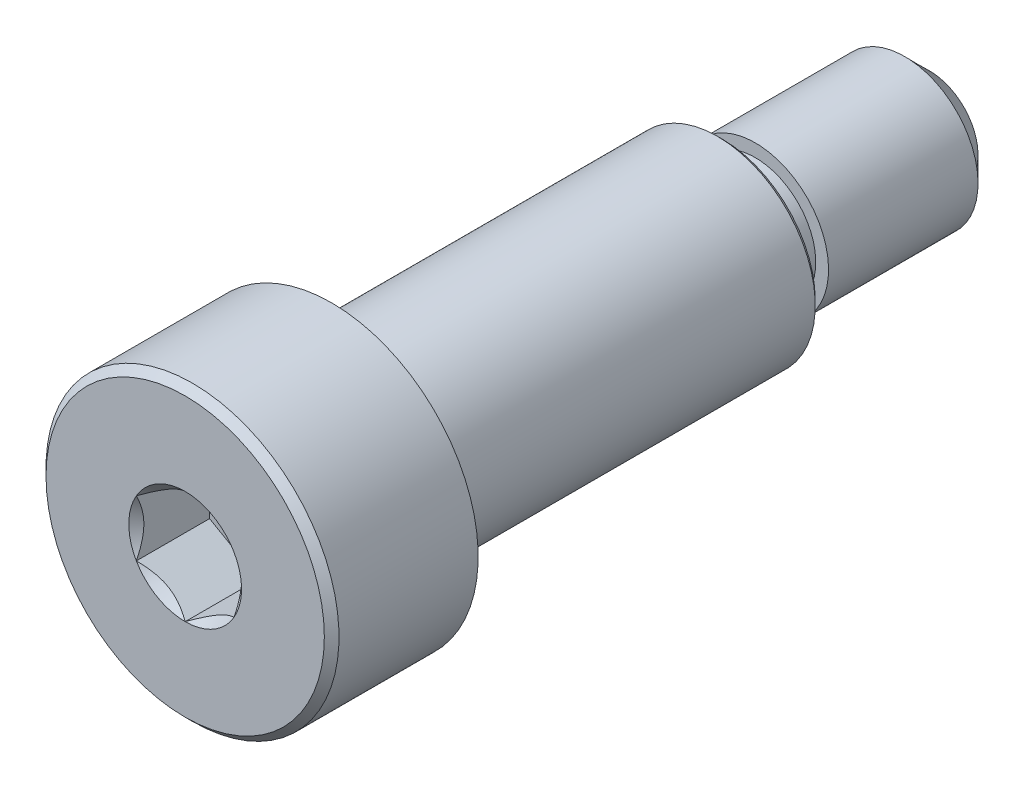
ISO-10303-21;
HEADER;
FILE_DESCRIPTION(('STEP AP214'),'2;1');
FILE_NAME('part.step','',(''),(''),'','','');
FILE_SCHEMA(('AUTOMOTIVE_DESIGN { 1 0 10303 214 1 1 1 1 }'));
ENDSEC;
DATA;
#1=APPLICATION_CONTEXT('core data for automotive mechanical design processes');
#2=APPLICATION_PROTOCOL_DEFINITION('international standard','automotive_design',2000,#1);
#3=PRODUCT_CONTEXT('',#1,'mechanical');
#4=PRODUCT('Part','Part','',(#3));
#5=PRODUCT_RELATED_PRODUCT_CATEGORY('part','',(#4));
#6=PRODUCT_DEFINITION_FORMATION('','',#4);
#7=PRODUCT_DEFINITION_CONTEXT('part definition',#1,'design');
#8=PRODUCT_DEFINITION('design','',#6,#7);
#9=PRODUCT_DEFINITION_SHAPE('','',#8);
#10=(LENGTH_UNIT() NAMED_UNIT(*) SI_UNIT(.MILLI.,.METRE.));
#11=(NAMED_UNIT(*) PLANE_ANGLE_UNIT() SI_UNIT($,.RADIAN.));
#12=(NAMED_UNIT(*) SI_UNIT($,.STERADIAN.) SOLID_ANGLE_UNIT());
#13=UNCERTAINTY_MEASURE_WITH_UNIT(LENGTH_MEASURE(1.E-05),#10,'distance_accuracy_value','');
#14=(GEOMETRIC_REPRESENTATION_CONTEXT(3) GLOBAL_UNCERTAINTY_ASSIGNED_CONTEXT((#13)) GLOBAL_UNIT_ASSIGNED_CONTEXT((#10,
#11,#12)) REPRESENTATION_CONTEXT('',''));
#15=CARTESIAN_POINT('',(0.,0.,0.));
#16=DIRECTION('',(0.,0.,1.));
#17=DIRECTION('',(1.,0.,0.));
#18=AXIS2_PLACEMENT_3D('',#15,#16,#17);
#19=CARTESIAN_POINT('',(0.,0.,7.621));
#20=DIRECTION('',(0.,0.,1.));
#21=DIRECTION('',(0.,-1.,0.));
#22=AXIS2_PLACEMENT_3D('',#19,#20,#21);
#23=CYLINDRICAL_SURFACE('',#22,3.);
#24=CARTESIAN_POINT('',(0.,0.,4.621));
#25=DIRECTION('',(0.,0.,1.));
#26=DIRECTION('',(0.,-1.,0.));
#27=AXIS2_PLACEMENT_3D('',#24,#25,#26);
#28=CIRCLE('',#27,3.);
#29=CARTESIAN_POINT('',(0.,-3.,4.621));
#30=VERTEX_POINT('',#29);
#31=EDGE_CURVE('E195',#30,#30,#28,.T.);
#32=ORIENTED_EDGE('',*,*,#31,.T.);
#33=EDGE_LOOP('',(#32));
#34=FACE_BOUND('',#33,.T.);
#35=CARTESIAN_POINT('',(0.,0.,7.471));
#36=DIRECTION('',(0.,0.,1.));
#37=DIRECTION('',(0.,-1.,0.));
#38=AXIS2_PLACEMENT_3D('',#35,#36,#37);
#39=CIRCLE('',#38,3.);
#40=CARTESIAN_POINT('',(0.,-3.,7.471));
#41=VERTEX_POINT('',#40);
#42=EDGE_CURVE('E455',#41,#41,#39,.T.);
#43=ORIENTED_EDGE('',*,*,#42,.F.);
#44=EDGE_LOOP('',(#43));
#45=FACE_BOUND('',#44,.T.);
#46=ADVANCED_FACE('F49',(#34,#45),#23,.T.);
#47=CARTESIAN_POINT('',(0.,2.,-3.379));
#48=DIRECTION('',(0.,0.,1.));
#49=DIRECTION('',(0.,-1.,0.));
#50=AXIS2_PLACEMENT_3D('',#47,#48,#49);
#51=PLANE('',#50);
#52=CARTESIAN_POINT('',(0.,0.,-3.379));
#53=DIRECTION('',(0.,0.,1.));
#54=DIRECTION('',(0.,-1.,0.));
#55=AXIS2_PLACEMENT_3D('',#52,#53,#54);
#56=CIRCLE('',#55,1.36904775);
#57=CARTESIAN_POINT('',(0.,-1.36904775,-3.379));
#58=VERTEX_POINT('',#57);
#59=EDGE_CURVE('E159',#58,#58,#56,.T.);
#60=ORIENTED_EDGE('',*,*,#59,.T.);
#61=EDGE_LOOP('',(#60));
#62=FACE_BOUND('',#61,.T.);
#63=CARTESIAN_POINT('',(0.,0.,-3.379));
#64=DIRECTION('',(0.,0.,1.));
#65=DIRECTION('',(0.,-1.,0.));
#66=AXIS2_PLACEMENT_3D('',#63,#64,#65);
#67=CIRCLE('',#66,1.5);
#68=CARTESIAN_POINT('',(0.,-1.5,-3.379));
#69=VERTEX_POINT('',#68);
#70=EDGE_CURVE('E186',#69,#69,#67,.T.);
#71=ORIENTED_EDGE('',*,*,#70,.F.);
#72=EDGE_LOOP('',(#71));
#73=FACE_BOUND('',#72,.T.);
#74=ADVANCED_FACE('F285',(#62,#73),#51,.F.);
#75=CARTESIAN_POINT('',(0.,1.5,-7.621));
#76=DIRECTION('',(0.,0.,1.));
#77=DIRECTION('',(0.,-1.,0.));
#78=AXIS2_PLACEMENT_3D('',#75,#76,#77);
#79=PLANE('',#78);
#80=CARTESIAN_POINT('',(0.,0.,-7.621));
#81=DIRECTION('',(0.,0.,1.));
#82=DIRECTION('',(0.,-1.,0.));
#83=AXIS2_PLACEMENT_3D('',#80,#81,#82);
#84=CIRCLE('',#83,0.993851983500002);
#85=CARTESIAN_POINT('',(0.,-0.993851983500002,-7.621));
#86=VERTEX_POINT('',#85);
#87=EDGE_CURVE('E12',#86,#86,#84,.F.);
#88=ORIENTED_EDGE('',*,*,#87,.T.);
#89=EDGE_LOOP('',(#88));
#90=FACE_BOUND('',#89,.T.);
#91=ADVANCED_FACE('F293',(#90),#79,.F.);
#92=CARTESIAN_POINT('',(0.,0.,7.621));
#93=DIRECTION('',(0.,0.,1.));
#94=DIRECTION('',(0.,-1.,0.));
#95=AXIS2_PLACEMENT_3D('',#92,#93,#94);
#96=CYLINDRICAL_SURFACE('',#95,1.5);
#97=CARTESIAN_POINT('',(0.,0.,-7.1148519835));
#98=DIRECTION('',(0.,0.,1.));
#99=DIRECTION('',(0.,-1.,0.));
#100=AXIS2_PLACEMENT_3D('',#97,#98,#99);
#101=CIRCLE('',#100,1.5);
#102=CARTESIAN_POINT('',(0.,-1.5,-7.1148519835));
#103=VERTEX_POINT('',#102);
#104=EDGE_CURVE('E58',#103,#103,#101,.T.);
#105=ORIENTED_EDGE('',*,*,#104,.T.);
#106=EDGE_LOOP('',(#105));
#107=FACE_BOUND('',#106,.T.);
#108=CARTESIAN_POINT('',(0.,0.,-4.053864022));
#109=DIRECTION('',(0.,0.,1.));
#110=DIRECTION('',(0.,-1.,0.));
#111=AXIS2_PLACEMENT_3D('',#108,#109,#110);
#112=CIRCLE('',#111,1.5);
#113=CARTESIAN_POINT('',(0.,-1.5,-4.053864022));
#114=VERTEX_POINT('',#113);
#115=EDGE_CURVE('E174',#114,#114,#112,.T.);
#116=ORIENTED_EDGE('',*,*,#115,.F.);
#117=EDGE_LOOP('',(#116));
#118=FACE_BOUND('',#117,.T.);
#119=ADVANCED_FACE('F489',(#107,#118),#96,.T.);
#120=CARTESIAN_POINT('',(0.,1.2380955,-4.053864022));
#121=DIRECTION('',(0.,0.,-1.));
#122=DIRECTION('',(0.,1.,0.));
#123=AXIS2_PLACEMENT_3D('',#120,#121,#122);
#124=PLANE('',#123);
#125=CARTESIAN_POINT('',(0.,0.,-4.053864022));
#126=DIRECTION('',(0.,0.,1.));
#127=DIRECTION('',(0.,-1.,0.));
#128=AXIS2_PLACEMENT_3D('',#125,#126,#127);
#129=CIRCLE('',#128,1.2380955);
#130=CARTESIAN_POINT('',(0.,-1.2380955,-4.053864022));
#131=VERTEX_POINT('',#130);
#132=EDGE_CURVE('E178',#131,#131,#129,.T.);
#133=ORIENTED_EDGE('',*,*,#132,.F.);
#134=EDGE_LOOP('',(#133));
#135=FACE_BOUND('',#134,.T.);
#136=ORIENTED_EDGE('',*,*,#115,.T.);
#137=EDGE_LOOP('',(#136));
#138=FACE_BOUND('',#137,.T.);
#139=ADVANCED_FACE('F332',(#135,#138),#124,.F.);
#140=CARTESIAN_POINT('',(0.,0.,7.621));
#141=DIRECTION('',(0.,0.,1.));
#142=DIRECTION('',(0.,-1.,0.));
#143=AXIS2_PLACEMENT_3D('',#140,#141,#142);
#144=CYLINDRICAL_SURFACE('',#143,1.2380955);
#145=CARTESIAN_POINT('',(0.,0.,-3.50995225));
#146=DIRECTION('',(0.,0.,1.));
#147=DIRECTION('',(0.,-1.,0.));
#148=AXIS2_PLACEMENT_3D('',#145,#146,#147);
#149=CIRCLE('',#148,1.2380955);
#150=CARTESIAN_POINT('',(0.,-1.2380955,-3.50995225));
#151=VERTEX_POINT('',#150);
#152=EDGE_CURVE('E182',#151,#151,#149,.T.);
#153=ORIENTED_EDGE('',*,*,#152,.F.);
#154=EDGE_LOOP('',(#153));
#155=FACE_BOUND('',#154,.T.);
#156=ORIENTED_EDGE('',*,*,#132,.T.);
#157=EDGE_LOOP('',(#156));
#158=FACE_BOUND('',#157,.T.);
#159=ADVANCED_FACE('F319',(#155,#158),#144,.T.);
#160=CARTESIAN_POINT('',(0.,0.,-3.50995225));
#161=DIRECTION('',(0.,0.,1.));
#162=DIRECTION('',(0.,-1.,0.));
#163=AXIS2_PLACEMENT_3D('',#160,#161,#162);
#164=TOROIDAL_SURFACE('',#163,1.36904775,0.13095225);
#165=ORIENTED_EDGE('',*,*,#59,.F.);
#166=EDGE_LOOP('',(#165));
#167=FACE_BOUND('',#166,.T.);
#168=ORIENTED_EDGE('',*,*,#152,.T.);
#169=EDGE_LOOP('',(#168));
#170=FACE_BOUND('',#169,.T.);
#171=ADVANCED_FACE('F314',(#167,#170),#164,.F.);
#172=CARTESIAN_POINT('',(0.,0.,-3.379));
#173=DIRECTION('',(0.,0.,-1.));
#174=DIRECTION('',(0.,1.,0.));
#175=AXIS2_PLACEMENT_3D('',#172,#173,#174);
#176=CONICAL_SURFACE('',#175,1.5,1.53309033997236);
#177=CARTESIAN_POINT('',(0.,0.,-3.3775637422897));
#178=DIRECTION('',(0.,0.,1.));
#179=DIRECTION('',(0.,-1.,0.));
#180=AXIS2_PLACEMENT_3D('',#177,#178,#179);
#181=CIRCLE('',#180,1.46192708096574);
#182=CARTESIAN_POINT('',(0.,-1.46192708096574,-3.3775637422897));
#183=VERTEX_POINT('',#182);
#184=EDGE_CURVE('E199',#183,#183,#181,.T.);
#185=ORIENTED_EDGE('',*,*,#184,.F.);
#186=EDGE_LOOP('',(#185));
#187=FACE_BOUND('',#186,.T.);
#188=ORIENTED_EDGE('',*,*,#70,.T.);
#189=EDGE_LOOP('',(#188));
#190=FACE_BOUND('',#189,.T.);
#191=ADVANCED_FACE('F311',(#187,#190),#176,.T.);
#192=CARTESIAN_POINT('',(0.,0.,4.4954362577103));
#193=DIRECTION('',(0.,0.,-1.));
#194=DIRECTION('',(0.,1.,0.));
#195=AXIS2_PLACEMENT_3D('',#192,#193,#194);
#196=CONICAL_SURFACE('',#195,1.75892708096574,1.53309033997227);
#197=CARTESIAN_POINT('',(0.,0.,4.494));
#198=DIRECTION('',(0.,0.,1.));
#199=DIRECTION('',(0.,-1.,0.));
#200=AXIS2_PLACEMENT_3D('',#197,#198,#199);
#201=CIRCLE('',#200,1.797);
#202=CARTESIAN_POINT('',(0.,-1.797,4.494));
#203=VERTEX_POINT('',#202);
#204=EDGE_CURVE('E194',#203,#203,#201,.T.);
#205=ORIENTED_EDGE('',*,*,#204,.F.);
#206=EDGE_LOOP('',(#205));
#207=FACE_BOUND('',#206,.T.);
#208=CARTESIAN_POINT('',(0.,0.,4.4954362577103));
#209=DIRECTION('',(0.,0.,1.));
#210=DIRECTION('',(0.,-1.,0.));
#211=AXIS2_PLACEMENT_3D('',#208,#209,#210);
#212=CIRCLE('',#211,1.75892708096574);
#213=CARTESIAN_POINT('',(0.,-1.75892708096574,4.4954362577103));
#214=VERTEX_POINT('',#213);
#215=EDGE_CURVE('E200',#214,#214,#212,.T.);
#216=ORIENTED_EDGE('',*,*,#215,.T.);
#217=EDGE_LOOP('',(#216));
#218=FACE_BOUND('',#217,.T.);
#219=ADVANCED_FACE('F307',(#207,#218),#196,.F.);
#220=CARTESIAN_POINT('',(0.,0.,4.4954362577103));
#221=DIRECTION('',(0.,0.,1.));
#222=DIRECTION('',(0.,-1.,0.));
#223=AXIS2_PLACEMENT_3D('',#220,#221,#222);
#224=CONICAL_SURFACE('',#223,1.75892708096574,0.0377059868226227);
#225=ORIENTED_EDGE('',*,*,#184,.T.);
#226=EDGE_LOOP('',(#225));
#227=FACE_BOUND('',#226,.T.);
#228=ORIENTED_EDGE('',*,*,#215,.F.);
#229=EDGE_LOOP('',(#228));
#230=FACE_BOUND('',#229,.T.);
#231=ADVANCED_FACE('F304',(#227,#230),#224,.T.);
#232=CARTESIAN_POINT('',(0.,3.,4.621));
#233=DIRECTION('',(0.,0.,1.));
#234=DIRECTION('',(0.,-1.,0.));
#235=AXIS2_PLACEMENT_3D('',#232,#233,#234);
#236=PLANE('',#235);
#237=ORIENTED_EDGE('',*,*,#31,.F.);
#238=EDGE_LOOP('',(#237));
#239=FACE_BOUND('',#238,.T.);
#240=CARTESIAN_POINT('',(0.,0.,4.621));
#241=DIRECTION('',(0.,0.,1.));
#242=DIRECTION('',(0.,-1.,0.));
#243=AXIS2_PLACEMENT_3D('',#240,#241,#242);
#244=CIRCLE('',#243,1.797);
#245=CARTESIAN_POINT('',(0.,-1.797,4.621));
#246=VERTEX_POINT('',#245);
#247=EDGE_CURVE('E190',#246,#246,#244,.T.);
#248=ORIENTED_EDGE('',*,*,#247,.T.);
#249=EDGE_LOOP('',(#248));
#250=FACE_BOUND('',#249,.T.);
#251=ADVANCED_FACE('F298',(#239,#250),#236,.F.);
#252=CARTESIAN_POINT('',(0.,0.,7.621));
#253=DIRECTION('',(0.,0.,1.));
#254=DIRECTION('',(0.,-1.,0.));
#255=AXIS2_PLACEMENT_3D('',#252,#253,#254);
#256=CYLINDRICAL_SURFACE('',#255,1.797);
#257=ORIENTED_EDGE('',*,*,#247,.F.);
#258=EDGE_LOOP('',(#257));
#259=FACE_BOUND('',#258,.T.);
#260=ORIENTED_EDGE('',*,*,#204,.T.);
#261=EDGE_LOOP('',(#260));
#262=FACE_BOUND('',#261,.T.);
#263=ADVANCED_FACE('F338',(#259,#262),#256,.T.);
#264=CARTESIAN_POINT('',(0.,0.,-7.1148519835));
#265=DIRECTION('',(0.,0.,1.));
#266=DIRECTION('',(0.,-1.,0.));
#267=AXIS2_PLACEMENT_3D('',#264,#265,#266);
#268=CONICAL_SURFACE('',#267,1.5,0.785398163397447);
#269=ORIENTED_EDGE('',*,*,#87,.F.);
#270=EDGE_LOOP('',(#269));
#271=FACE_BOUND('',#270,.T.);
#272=ORIENTED_EDGE('',*,*,#104,.F.);
#273=EDGE_LOOP('',(#272));
#274=FACE_BOUND('',#273,.T.);
#275=ADVANCED_FACE('F51',(#271,#274),#268,.T.);
#276=CARTESIAN_POINT('',(0.,0.,7.621));
#277=DIRECTION('',(0.,0.,-1.));
#278=DIRECTION('',(0.,1.,0.));
#279=AXIS2_PLACEMENT_3D('',#276,#277,#278);
#280=CONICAL_SURFACE('',#279,2.85,0.785398163397443);
#281=ORIENTED_EDGE('',*,*,#42,.T.);
#282=EDGE_LOOP('',(#281));
#283=FACE_BOUND('',#282,.T.);
#284=CARTESIAN_POINT('',(0.,0.,7.621));
#285=DIRECTION('',(0.,0.,1.));
#286=DIRECTION('',(0.,-1.,0.));
#287=AXIS2_PLACEMENT_3D('',#284,#285,#286);
#288=CIRCLE('',#287,2.85);
#289=CARTESIAN_POINT('',(0.,-2.85,7.621));
#290=VERTEX_POINT('',#289);
#291=EDGE_CURVE('E458',#290,#290,#288,.T.);
#292=ORIENTED_EDGE('',*,*,#291,.F.);
#293=EDGE_LOOP('',(#292));
#294=FACE_BOUND('',#293,.T.);
#295=ADVANCED_FACE('F230',(#283,#294),#280,.T.);
#296=CARTESIAN_POINT('',(0.,0.,6.121));
#297=DIRECTION('',(0.,0.,1.));
#298=DIRECTION('',(1.,0.,0.));
#299=AXIS2_PLACEMENT_3D('',#296,#297,#298);
#300=PLANE('',#299);
#301=DIRECTION('',(-0.866025403784439,0.499999999999999,0.));
#302=VECTOR('',#301,1.);
#303=CARTESIAN_POINT('',(0.999999999999999,0.577350269189627,6.121));
#304=LINE('',#303,#302);
#305=CARTESIAN_POINT('',(0.999999999999999,0.577350269189627,6.121));
#306=VERTEX_POINT('',#305);
#307=CARTESIAN_POINT('',(0.,1.15470053837925,6.121));
#308=VERTEX_POINT('',#307);
#309=EDGE_CURVE('E109',#306,#308,#304,.T.);
#310=ORIENTED_EDGE('',*,*,#309,.T.);
#311=DIRECTION('',(-0.866025403784438,-0.5,0.));
#312=VECTOR('',#311,1.);
#313=CARTESIAN_POINT('',(0.,1.15470053837925,6.121));
#314=LINE('',#313,#312);
#315=CARTESIAN_POINT('',(-1.,0.577350269189626,6.121));
#316=VERTEX_POINT('',#315);
#317=EDGE_CURVE('E120',#308,#316,#314,.T.);
#318=ORIENTED_EDGE('',*,*,#317,.T.);
#319=DIRECTION('',(0.,-1.,0.));
#320=VECTOR('',#319,1.);
#321=CARTESIAN_POINT('',(-1.,0.577350269189626,6.121));
#322=LINE('',#321,#320);
#323=CARTESIAN_POINT('',(-1.,-0.577350269189625,6.121));
#324=VERTEX_POINT('',#323);
#325=EDGE_CURVE('E127',#316,#324,#322,.T.);
#326=ORIENTED_EDGE('',*,*,#325,.T.);
#327=DIRECTION('',(0.866025403784439,-0.499999999999999,0.));
#328=VECTOR('',#327,1.);
#329=CARTESIAN_POINT('',(-1.,-0.577350269189625,6.121));
#330=LINE('',#329,#328);
#331=CARTESIAN_POINT('',(0.,-1.15470053837925,6.121));
#332=VERTEX_POINT('',#331);
#333=EDGE_CURVE('E147',#324,#332,#330,.T.);
#334=ORIENTED_EDGE('',*,*,#333,.T.);
#335=DIRECTION('',(0.866025403784438,0.5,0.));
#336=VECTOR('',#335,1.);
#337=CARTESIAN_POINT('',(0.,-1.15470053837925,6.121));
#338=LINE('',#337,#336);
#339=CARTESIAN_POINT('',(0.999999999999999,-0.577350269189625,6.121));
#340=VERTEX_POINT('',#339);
#341=EDGE_CURVE('E151',#332,#340,#338,.T.);
#342=ORIENTED_EDGE('',*,*,#341,.T.);
#343=DIRECTION('',(0.,1.,0.));
#344=VECTOR('',#343,1.);
#345=CARTESIAN_POINT('',(0.999999999999999,-0.577350269189625,6.121));
#346=LINE('',#345,#344);
#347=EDGE_CURVE('E117',#340,#306,#346,.T.);
#348=ORIENTED_EDGE('',*,*,#347,.T.);
#349=EDGE_LOOP('',(#310,#318,#326,#334,#342,#348));
#350=FACE_BOUND('',#349,.T.);
#351=ADVANCED_FACE('F129',(#350),#300,.T.);
#352=CARTESIAN_POINT('',(-1.,0.577350269189626,6.121));
#353=DIRECTION('',(-1.,0.,0.));
#354=DIRECTION('',(0.,-1.,0.));
#355=AXIS2_PLACEMENT_3D('',#352,#353,#354);
#356=PLANE('',#355);
#357=DIRECTION('',(0.,0.,1.));
#358=VECTOR('',#357,1.);
#359=CARTESIAN_POINT('',(-1.,0.577350269189626,6.121));
#360=LINE('',#359,#358);
#361=CARTESIAN_POINT('',(-0.999999999999999,0.577350269189627,7.621));
#362=VERTEX_POINT('',#361);
#363=EDGE_CURVE('E116',#316,#362,#360,.T.);
#364=ORIENTED_EDGE('',*,*,#363,.T.);
#365=CARTESIAN_POINT('',(-1.,-1.15147208646462,7.99138567751386));
#366=CARTESIAN_POINT('',(-1.,-1.12343447988552,7.97021991987371));
#367=CARTESIAN_POINT('',(-1.,-1.09524064850697,7.94926169217591));
#368=CARTESIAN_POINT('',(-1.,-1.03847715644376,7.90784602223562));
#369=CARTESIAN_POINT('',(-1.,-1.00990740382975,7.88738870612366));
#370=CARTESIAN_POINT('',(-1.,-0.923120894333477,7.82660479495451));
#371=CARTESIAN_POINT('',(-1.,-0.864253173759059,7.7871922289614));
#372=CARTESIAN_POINT('',(-1.,-0.740809858258045,7.7098206642002));
#373=CARTESIAN_POINT('',(-1.,-0.676100255137807,7.67207303911434));
#374=CARTESIAN_POINT('',(-1.,-0.543448939049124,7.60302458755129));
#375=CARTESIAN_POINT('',(-1.,-0.475519112027779,7.57170202784686));
#376=CARTESIAN_POINT('',(-1.,-0.373555850333529,7.53338177888379));
#377=CARTESIAN_POINT('',(-1.,-0.341031989670908,7.52238359164216));
#378=CARTESIAN_POINT('',(-1.,-0.275199079052293,7.50299834214736));
#379=CARTESIAN_POINT('',(-1.,-0.241889975173933,7.4946114597767));
#380=CARTESIAN_POINT('',(-1.,-0.175247517042993,7.48102522071902));
#381=CARTESIAN_POINT('',(-1.,-0.141925568218175,7.47577079076797));
#382=CARTESIAN_POINT('',(-1.,-0.0749144362322795,7.46854868657089));
#383=CARTESIAN_POINT('',(-1.,-0.0412251978501624,7.46658151361051));
#384=CARTESIAN_POINT('',(-1.,0.0249580992634202,7.46608319839316));
#385=CARTESIAN_POINT('',(-1.,0.0574512826460384,7.46743026788863));
#386=CARTESIAN_POINT('',(-1.,0.122148505701866,7.47321648449898));
#387=CARTESIAN_POINT('',(-1.,0.154352610132926,7.47765492066153));
#388=CARTESIAN_POINT('',(-1.,0.218799898867639,7.4894568301452));
#389=CARTESIAN_POINT('',(-1.,0.251033743268953,7.49687054103851));
#390=CARTESIAN_POINT('',(-1.,0.314797132354918,7.51422894249868));
#391=CARTESIAN_POINT('',(-1.,0.346326735731003,7.52417342128883));
#392=CARTESIAN_POINT('',(-1.,0.445594187730203,7.55922348255434));
#393=CARTESIAN_POINT('',(-1.,0.511919139476034,7.58832085835672));
#394=CARTESIAN_POINT('',(-1.,0.64145324465753,7.6530153296865));
#395=CARTESIAN_POINT('',(-1.,0.704650133126342,7.68863577671524));
#396=CARTESIAN_POINT('',(-1.,0.825428490174985,7.76212390134693));
#397=CARTESIAN_POINT('',(-1.,0.883132947867683,7.79979194713546));
#398=CARTESIAN_POINT('',(-1.,0.968148853704564,7.85802285294316));
#399=CARTESIAN_POINT('',(-1.,0.996120570380284,7.87763847576286));
#400=CARTESIAN_POINT('',(-1.,1.05168177729901,7.91738851706127));
#401=CARTESIAN_POINT('',(-1.,1.079271369977,7.93752279219883));
#402=CARTESIAN_POINT('',(-1.,1.10670185346329,7.95787211907297));
#403=B_SPLINE_CURVE_WITH_KNOTS('',3,(#365,#366,#367,#368,#369,#370,#371,#372,#373,#374,#375,
#376,#377,#378,#379,#380,#381,#382,#383,#384,#385,#386,#387,#388,#389,#390,#391,#392,#393,#394,
#395,#396,#397,#398,#399,#400,#401,#402),.UNSPECIFIED.,.F.,.F.,(4,2,2,2,2,2,2,2,2,2,2,2,2,2,2,2,
2,2,4),(0.,0.10538645908329,0.210799187330122,0.423233611565467,0.647793540908502,
0.871580877738608,0.974493074181419,1.07741235827201,1.17846428203204,1.27953161415762,
1.3769408673961,1.47432772585408,1.57343322804293,1.67253043972851,1.88917353996827,
2.10660791038812,2.31323734249843,2.41572589232044,2.51818641476503),.UNSPECIFIED.);
#404=CARTESIAN_POINT('',(-1.,-0.577350269189627,7.621));
#405=VERTEX_POINT('',#404);
#406=EDGE_CURVE('E237',#362,#405,#403,.F.);
#407=ORIENTED_EDGE('',*,*,#406,.T.);
#408=DIRECTION('',(0.,0.,1.));
#409=VECTOR('',#408,1.);
#410=CARTESIAN_POINT('',(-1.,-0.577350269189625,6.121));
#411=LINE('',#410,#409);
#412=EDGE_CURVE('E168',#324,#405,#411,.T.);
#413=ORIENTED_EDGE('',*,*,#412,.F.);
#414=ORIENTED_EDGE('',*,*,#325,.F.);
#415=EDGE_LOOP('',(#364,#407,#413,#414));
#416=FACE_BOUND('',#415,.T.);
#417=ADVANCED_FACE('F275',(#416),#356,.F.);
#418=CARTESIAN_POINT('',(-1.,-0.577350269189625,6.121));
#419=DIRECTION('',(-0.499999999999999,-0.866025403784439,0.));
#420=DIRECTION('',(0.866025403784439,-0.5,0.));
#421=AXIS2_PLACEMENT_3D('',#418,#419,#420);
#422=PLANE('',#421);
#423=ORIENTED_EDGE('',*,*,#412,.T.);
#424=CARTESIAN_POINT('',(-1.0002,-0.577234799135788,7.62111548737261));
#425=CARTESIAN_POINT('',(-0.965817404992819,-0.597085599618621,7.60127793082573));
#426=CARTESIAN_POINT('',(-0.930859881860175,-0.617268335009456,7.58260502063889));
#427=CARTESIAN_POINT('',(-0.85957719704391,-0.658423412276686,7.54841474272316));
#428=CARTESIAN_POINT('',(-0.823245249471015,-0.67939967198808,7.53291640902346));
#429=CARTESIAN_POINT('',(-0.749983386196688,-0.721697428470846,7.50636730714226));
#430=CARTESIAN_POINT('',(-0.713072148554585,-0.743008141459637,7.49524977399692));
#431=CARTESIAN_POINT('',(-0.63843727068914,-0.786098608286186,7.47811986577618));
#432=CARTESIAN_POINT('',(-0.600715911891363,-0.807877044942281,7.47209469746667));
#433=CARTESIAN_POINT('',(-0.535707801582066,-0.845409494928863,7.46666055496749));
#434=CARTESIAN_POINT('',(-0.508505628471827,-0.861114676896602,7.46585693831673));
#435=CARTESIAN_POINT('',(-0.454153959330887,-0.892494627706029,7.46720669941689));
#436=CARTESIAN_POINT('',(-0.427004476245124,-0.908169389073953,7.4693607295472));
#437=CARTESIAN_POINT('',(-0.345943722673039,-0.95496983696951,7.48011697212847));
#438=CARTESIAN_POINT('',(-0.292435859021572,-0.985862616452447,7.49301455641535));
#439=CARTESIAN_POINT('',(-0.198523934856568,-1.04008269114923,7.52414073060218));
#440=CARTESIAN_POINT('',(-0.157679476328165,-1.06366425027551,7.54073779770184));
#441=CARTESIAN_POINT('',(-0.0775903626180558,-1.1099037216352,7.57812492468529));
#442=CARTESIAN_POINT('',(-0.0383409891295616,-1.1325643579843,7.5989013418174));
#443=CARTESIAN_POINT('',(0.000200000000000623,-1.15481600843309,7.62111548737261));
#444=B_SPLINE_CURVE_WITH_KNOTS('',3,(#424,#425,#426,#427,#428,#429,#430,#431,#432,#433,#434,
#435,#436,#437,#438,#439,#440,#441,#442,#443),.UNSPECIFIED.,.F.,.F.,(4,2,2,2,2,2,2,2,2,4),(0.,
0.13323767682856,0.267252229834491,0.399137076269301,0.530689603280769,0.624814864263846,
0.718960890149133,0.907306626112098,1.05710100361789,1.20641411519286),.UNSPECIFIED.);
#445=CARTESIAN_POINT('',(0.,-1.15470053837925,7.621));
#446=VERTEX_POINT('',#445);
#447=EDGE_CURVE('E245',#405,#446,#444,.T.);
#448=ORIENTED_EDGE('',*,*,#447,.T.);
#449=DIRECTION('',(0.,0.,1.));
#450=VECTOR('',#449,1.);
#451=CARTESIAN_POINT('',(0.,-1.15470053837925,6.121));
#452=LINE('',#451,#450);
#453=EDGE_CURVE('E164',#332,#446,#452,.T.);
#454=ORIENTED_EDGE('',*,*,#453,.F.);
#455=ORIENTED_EDGE('',*,*,#333,.F.);
#456=EDGE_LOOP('',(#423,#448,#454,#455));
#457=FACE_BOUND('',#456,.T.);
#458=ADVANCED_FACE('F271',(#457),#422,.F.);
#459=CARTESIAN_POINT('',(0.,-1.15470053837925,6.121));
#460=DIRECTION('',(0.5,-0.866025403784438,0.));
#461=DIRECTION('',(0.866025403784438,0.5,0.));
#462=AXIS2_PLACEMENT_3D('',#459,#460,#461);
#463=PLANE('',#462);
#464=ORIENTED_EDGE('',*,*,#453,.T.);
#465=CARTESIAN_POINT('',(-0.000199999999999277,-1.15481600843309,7.62111548737261));
#466=CARTESIAN_POINT('',(0.0341825950071812,-1.13496520795026,7.60127793082573));
#467=CARTESIAN_POINT('',(0.0691401181398254,-1.11478247255942,7.58260502063889));
#468=CARTESIAN_POINT('',(0.14042280295609,-1.07362739529219,7.54841474272316));
#469=CARTESIAN_POINT('',(0.176754750528985,-1.0526511355808,7.53291640902346));
#470=CARTESIAN_POINT('',(0.250016613803312,-1.01035337909803,7.50636730714226));
#471=CARTESIAN_POINT('',(0.286927851445415,-0.98904266610924,7.49524977399692));
#472=CARTESIAN_POINT('',(0.36156272931086,-0.94595219928269,7.47811986577618));
#473=CARTESIAN_POINT('',(0.399284088108636,-0.924173762626595,7.47209469746667));
#474=CARTESIAN_POINT('',(0.464292198417934,-0.886641312640014,7.46666055496749));
#475=CARTESIAN_POINT('',(0.491494371528172,-0.870936130672274,7.46585693831673));
#476=CARTESIAN_POINT('',(0.545846040669112,-0.839556179862847,7.46720669941689));
#477=CARTESIAN_POINT('',(0.572995523754876,-0.823881418494923,7.4693607295472));
#478=CARTESIAN_POINT('',(0.65405627732696,-0.777080970599366,7.48011697212847));
#479=CARTESIAN_POINT('',(0.707564140978427,-0.746188191116429,7.49301455641536));
#480=CARTESIAN_POINT('',(0.801476065143431,-0.691968116419648,7.52414073060218));
#481=CARTESIAN_POINT('',(0.842320523671834,-0.668386557293371,7.54073779770184));
#482=CARTESIAN_POINT('',(0.922409637381943,-0.622147085933681,7.57812492468529));
#483=CARTESIAN_POINT('',(0.961659010870437,-0.599486449584574,7.5989013418174));
#484=CARTESIAN_POINT('',(1.0002,-0.577234799135787,7.62111548737261));
#485=B_SPLINE_CURVE_WITH_KNOTS('',3,(#465,#466,#467,#468,#469,#470,#471,#472,#473,#474,#475,
#476,#477,#478,#479,#480,#481,#482,#483,#484),.UNSPECIFIED.,.F.,.F.,(4,2,2,2,2,2,2,2,2,4),(0.,
0.133237676828559,0.26725222983449,0.3991370762693,0.530689603280768,0.624814864263846,
0.718960890149133,0.907306626112097,1.05710100361789,1.20641411519286),.UNSPECIFIED.);
#486=CARTESIAN_POINT('',(1.,-0.577350269189624,7.621));
#487=VERTEX_POINT('',#486);
#488=EDGE_CURVE('E252',#446,#487,#485,.T.);
#489=ORIENTED_EDGE('',*,*,#488,.T.);
#490=DIRECTION('',(0.,0.,1.));
#491=VECTOR('',#490,1.);
#492=CARTESIAN_POINT('',(0.999999999999999,-0.577350269189625,6.121));
#493=LINE('',#492,#491);
#494=EDGE_CURVE('E160',#340,#487,#493,.T.);
#495=ORIENTED_EDGE('',*,*,#494,.F.);
#496=ORIENTED_EDGE('',*,*,#341,.F.);
#497=EDGE_LOOP('',(#464,#489,#495,#496));
#498=FACE_BOUND('',#497,.T.);
#499=ADVANCED_FACE('F267',(#498),#463,.F.);
#500=CARTESIAN_POINT('',(0.999999999999999,-0.577350269189625,6.121));
#501=DIRECTION('',(1.,0.,0.));
#502=DIRECTION('',(0.,1.,0.));
#503=AXIS2_PLACEMENT_3D('',#500,#501,#502);
#504=PLANE('',#503);
#505=ORIENTED_EDGE('',*,*,#494,.T.);
#506=CARTESIAN_POINT('',(0.999999999999999,-1.15147208663215,7.99138567764035));
#507=CARTESIAN_POINT('',(0.999999999999999,-1.12343448004835,7.97021991999533));
#508=CARTESIAN_POINT('',(0.999999999999999,-1.09524064866509,7.94926169229266));
#509=CARTESIAN_POINT('',(0.999999999999999,-1.0384771565924,7.90784602234267));
#510=CARTESIAN_POINT('',(0.999999999999999,-1.00990740397362,7.88738870622587));
#511=CARTESIAN_POINT('',(0.999999999999999,-0.923120894462774,7.82660479504213));
#512=CARTESIAN_POINT('',(0.999999999999999,-0.864253173878444,7.78719222903932));
#513=CARTESIAN_POINT('',(0.999999999999999,-0.74080985835581,7.70982066425819));
#514=CARTESIAN_POINT('',(0.999999999999999,-0.676100255223808,7.67207303916216));
#515=CARTESIAN_POINT('',(0.999999999999999,-0.543448939110597,7.60302458758025));
#516=CARTESIAN_POINT('',(0.999999999999999,-0.475519112076495,7.57170202786713));
#517=CARTESIAN_POINT('',(0.999999999999999,-0.373555850372648,7.5333817788976));
#518=CARTESIAN_POINT('',(0.999999999999999,-0.341031989714046,7.52238359165622));
#519=CARTESIAN_POINT('',(0.999999999999999,-0.275199079103601,7.50299834216111));
#520=CARTESIAN_POINT('',(0.999999999999999,-0.241889975229392,7.49461145978989));
#521=CARTESIAN_POINT('',(0.999999999999999,-0.175247517106615,7.48102522073014));
#522=CARTESIAN_POINT('',(0.999999999999999,-0.141925568285808,7.47577079077761));
#523=CARTESIAN_POINT('',(0.999999999999999,-0.0749144363078015,7.46854868657667));
#524=CARTESIAN_POINT('',(0.999999999999999,-0.0412251979295633,7.4665815136139));
#525=CARTESIAN_POINT('',(0.999999999999999,0.0249580991768636,7.46608319839111));
#526=CARTESIAN_POINT('',(0.999999999999999,0.0574512825561951,7.46743026788357));
#527=CARTESIAN_POINT('',(0.999999999999999,0.122148505605778,7.47321648448742));
#528=CARTESIAN_POINT('',(0.999999999999999,0.15435261003388,7.47765492064648));
#529=CARTESIAN_POINT('',(0.999999999999999,0.218799898762754,7.48945683012285));
#530=CARTESIAN_POINT('',(0.999999999999999,0.251033743161195,7.49687054101231));
#531=CARTESIAN_POINT('',(0.999999999999999,0.314797132241692,7.51422894246471));
#532=CARTESIAN_POINT('',(0.999999999999999,0.346326735615182,7.52417342125094));
#533=CARTESIAN_POINT('',(0.999999999999999,0.445594187589163,7.55922348249794));
#534=CARTESIAN_POINT('',(0.999999999999999,0.511919139313633,7.5883208582833));
#535=CARTESIAN_POINT('',(0.999999999999999,0.641453244454047,7.65301532957715));
#536=CARTESIAN_POINT('',(0.999999999999999,0.704650132903149,7.68863577658696));
#537=CARTESIAN_POINT('',(0.999999999999999,0.825428489916354,7.76212390118245));
#538=CARTESIAN_POINT('',(0.999999999999999,0.883132947593199,7.79979194695385));
#539=CARTESIAN_POINT('',(0.999999999999999,0.968148853406639,7.85802285273595));
#540=CARTESIAN_POINT('',(0.999999999999999,0.996120570074657,7.87763847554718));
#541=CARTESIAN_POINT('',(0.999999999999999,1.05168177697804,7.91738851682867));
#542=CARTESIAN_POINT('',(0.999999999999999,1.07927136964837,7.93752279195778));
#543=CARTESIAN_POINT('',(0.999999999999999,1.10670185312703,7.95787211882347));
#544=B_SPLINE_CURVE_WITH_KNOTS('',3,(#506,#507,#508,#509,#510,#511,#512,#513,#514,#515,#516,
#517,#518,#519,#520,#521,#522,#523,#524,#525,#526,#527,#528,#529,#530,#531,#532,#533,#534,#535,
#536,#537,#538,#539,#540,#541,#542,#543),.UNSPECIFIED.,.F.,.F.,(4,2,2,2,2,2,2,2,2,2,2,2,2,2,2,2,
2,2,4),(0.,0.10538645910335,0.210799187370248,0.423233611646473,0.64779354103535,
0.871580877910864,0.974493074342053,1.07741235842104,1.17846428216995,1.27953161428439,
1.37694086751269,1.47432772596047,1.57343322813835,1.67253043981296,1.88917353997386,
2.10660791031433,2.31323734235671,2.41572589214523,2.51818641455632),.UNSPECIFIED.);
#545=CARTESIAN_POINT('',(0.999999999999999,0.577350269189626,7.621));
#546=VERTEX_POINT('',#545);
#547=EDGE_CURVE('E135',#487,#546,#544,.T.);
#548=ORIENTED_EDGE('',*,*,#547,.T.);
#549=DIRECTION('',(0.,0.,1.));
#550=VECTOR('',#549,1.);
#551=CARTESIAN_POINT('',(0.999999999999999,0.577350269189627,6.121));
#552=LINE('',#551,#550);
#553=EDGE_CURVE('E156',#306,#546,#552,.T.);
#554=ORIENTED_EDGE('',*,*,#553,.F.);
#555=ORIENTED_EDGE('',*,*,#347,.F.);
#556=EDGE_LOOP('',(#505,#548,#554,#555));
#557=FACE_BOUND('',#556,.T.);
#558=ADVANCED_FACE('F264',(#557),#504,.F.);
#559=CARTESIAN_POINT('',(0.999999999999999,0.577350269189627,6.121));
#560=DIRECTION('',(0.499999999999999,0.866025403784439,0.));
#561=DIRECTION('',(-0.866025403784439,0.499999999999999,0.));
#562=AXIS2_PLACEMENT_3D('',#559,#560,#561);
#563=PLANE('',#562);
#564=ORIENTED_EDGE('',*,*,#553,.T.);
#565=CARTESIAN_POINT('',(1.0002,0.577234799135789,7.62111548737261));
#566=CARTESIAN_POINT('',(0.965817404992818,0.597085599618623,7.60127793082573));
#567=CARTESIAN_POINT('',(0.930859881860174,0.617268335009458,7.58260502063889));
#568=CARTESIAN_POINT('',(0.859577197043909,0.658423412276687,7.54841474272316));
#569=CARTESIAN_POINT('',(0.823245249471015,0.679399671988081,7.53291640902346));
#570=CARTESIAN_POINT('',(0.749983386196688,0.721697428470847,7.50636730714227));
#571=CARTESIAN_POINT('',(0.713072148554585,0.743008141459637,7.49524977399693));
#572=CARTESIAN_POINT('',(0.638437270689141,0.786098608286187,7.47811986577618));
#573=CARTESIAN_POINT('',(0.600715911891364,0.807877044942282,7.47209469746667));
#574=CARTESIAN_POINT('',(0.535707801582066,0.845409494928863,7.46666055496749));
#575=CARTESIAN_POINT('',(0.508505628471827,0.861114676896602,7.46585693831673));
#576=CARTESIAN_POINT('',(0.454153959330887,0.89249462770603,7.46720669941689));
#577=CARTESIAN_POINT('',(0.427004476245124,0.908169389073954,7.4693607295472));
#578=CARTESIAN_POINT('',(0.345943722673039,0.954969836969511,7.48011697212847));
#579=CARTESIAN_POINT('',(0.292435859021572,0.985862616452448,7.49301455641536));
#580=CARTESIAN_POINT('',(0.198523934856568,1.04008269114923,7.52414073060218));
#581=CARTESIAN_POINT('',(0.157679476328165,1.06366425027551,7.54073779770184));
#582=CARTESIAN_POINT('',(0.0775903626180556,1.1099037216352,7.57812492468529));
#583=CARTESIAN_POINT('',(0.0383409891295615,1.1325643579843,7.5989013418174));
#584=CARTESIAN_POINT('',(-0.000200000000000471,1.15481600843309,7.62111548737261));
#585=B_SPLINE_CURVE_WITH_KNOTS('',3,(#565,#566,#567,#568,#569,#570,#571,#572,#573,#574,#575,
#576,#577,#578,#579,#580,#581,#582,#583,#584),.UNSPECIFIED.,.F.,.F.,(4,2,2,2,2,2,2,2,2,4),(0.,
0.133237676828559,0.267252229834489,0.399137076269299,0.530689603280767,0.624814864263845,
0.718960890149132,0.907306626112096,1.05710100361789,1.20641411519286),.UNSPECIFIED.);
#586=CARTESIAN_POINT('',(0.,1.15470053837925,7.621));
#587=VERTEX_POINT('',#586);
#588=EDGE_CURVE('E111',#546,#587,#585,.T.);
#589=ORIENTED_EDGE('',*,*,#588,.T.);
#590=DIRECTION('',(0.,0.,1.));
#591=VECTOR('',#590,1.);
#592=CARTESIAN_POINT('',(0.,1.15470053837925,6.121));
#593=LINE('',#592,#591);
#594=EDGE_CURVE('E104',#308,#587,#593,.T.);
#595=ORIENTED_EDGE('',*,*,#594,.F.);
#596=ORIENTED_EDGE('',*,*,#309,.F.);
#597=EDGE_LOOP('',(#564,#589,#595,#596));
#598=FACE_BOUND('',#597,.T.);
#599=ADVANCED_FACE('F107',(#598),#563,.F.);
#600=CARTESIAN_POINT('',(0.,1.15470053837925,6.121));
#601=DIRECTION('',(-0.5,0.866025403784439,0.));
#602=DIRECTION('',(-0.866025403784439,-0.5,0.));
#603=AXIS2_PLACEMENT_3D('',#600,#601,#602);
#604=PLANE('',#603);
#605=ORIENTED_EDGE('',*,*,#594,.T.);
#606=CARTESIAN_POINT('',(0.000199999999999266,1.15481600843309,7.62111548737261));
#607=CARTESIAN_POINT('',(-0.0341825950071815,1.13496520795026,7.60127793082573));
#608=CARTESIAN_POINT('',(-0.0691401181398256,1.11478247255942,7.58260502063889));
#609=CARTESIAN_POINT('',(-0.14042280295609,1.07362739529219,7.54841474272316));
#610=CARTESIAN_POINT('',(-0.176754750528985,1.0526511355808,7.53291640902346));
#611=CARTESIAN_POINT('',(-0.250016613803312,1.01035337909803,7.50636730714227));
#612=CARTESIAN_POINT('',(-0.286927851445415,0.989042666109241,7.49524977399693));
#613=CARTESIAN_POINT('',(-0.36156272931086,0.945952199282691,7.47811986577618));
#614=CARTESIAN_POINT('',(-0.399284088108636,0.924173762626596,7.47209469746667));
#615=CARTESIAN_POINT('',(-0.464292198417934,0.886641312640014,7.46666055496749));
#616=CARTESIAN_POINT('',(-0.491494371528173,0.870936130672275,7.46585693831673));
#617=CARTESIAN_POINT('',(-0.545846040669113,0.839556179862848,7.46720669941689));
#618=CARTESIAN_POINT('',(-0.572995523754876,0.823881418494923,7.4693607295472));
#619=CARTESIAN_POINT('',(-0.654056277326961,0.777080970599366,7.48011697212847));
#620=CARTESIAN_POINT('',(-0.707564140978428,0.74618819111643,7.49301455641536));
#621=CARTESIAN_POINT('',(-0.801476065143432,0.691968116419649,7.52414073060218));
#622=CARTESIAN_POINT('',(-0.842320523671835,0.668386557293371,7.54073779770184));
#623=CARTESIAN_POINT('',(-0.922409637381944,0.622147085933681,7.57812492468529));
#624=CARTESIAN_POINT('',(-0.961659010870438,0.599486449584575,7.5989013418174));
#625=CARTESIAN_POINT('',(-1.0002,0.577234799135788,7.62111548737261));
#626=B_SPLINE_CURVE_WITH_KNOTS('',3,(#606,#607,#608,#609,#610,#611,#612,#613,#614,#615,#616,
#617,#618,#619,#620,#621,#622,#623,#624,#625),.UNSPECIFIED.,.F.,.F.,(4,2,2,2,2,2,2,2,2,4),(0.,
0.133237676828559,0.26725222983449,0.3991370762693,0.530689603280768,0.624814864263846,
0.718960890149133,0.907306626112097,1.05710100361789,1.20641411519286),.UNSPECIFIED.);
#627=EDGE_CURVE('E213',#587,#362,#626,.T.);
#628=ORIENTED_EDGE('',*,*,#627,.T.);
#629=ORIENTED_EDGE('',*,*,#363,.F.);
#630=ORIENTED_EDGE('',*,*,#317,.F.);
#631=EDGE_LOOP('',(#605,#628,#629,#630));
#632=FACE_BOUND('',#631,.T.);
#633=ADVANCED_FACE('F121',(#632),#604,.F.);
#634=CARTESIAN_POINT('',(0.,0.,7.621));
#635=DIRECTION('',(0.,0.,1.));
#636=DIRECTION('',(1.,0.,0.));
#637=AXIS2_PLACEMENT_3D('',#634,#635,#636);
#638=CONICAL_SURFACE('',#637,1.15470053837925,0.78539816339745);
#639=CARTESIAN_POINT('',(0.,0.,7.621));
#640=DIRECTION('',(0.,0.,1.));
#641=DIRECTION('',(1.,0.,0.));
#642=AXIS2_PLACEMENT_3D('',#639,#640,#641);
#643=CIRCLE('',#642,1.15470053837925);
#644=EDGE_CURVE('E474',#362,#405,#643,.T.);
#645=ORIENTED_EDGE('',*,*,#644,.T.);
#646=ORIENTED_EDGE('',*,*,#406,.F.);
#647=EDGE_LOOP('',(#645,#646));
#648=FACE_BOUND('',#647,.T.);
#649=ADVANCED_FACE('F391',(#648),#638,.F.);
#650=EDGE_CURVE('E477',#405,#446,#643,.T.);
#651=ORIENTED_EDGE('',*,*,#650,.T.);
#652=ORIENTED_EDGE('',*,*,#447,.F.);
#653=EDGE_LOOP('',(#651,#652));
#654=FACE_BOUND('',#653,.T.);
#655=ADVANCED_FACE('F407',(#654),#638,.F.);
#656=EDGE_CURVE('E71',#446,#487,#643,.T.);
#657=ORIENTED_EDGE('',*,*,#656,.T.);
#658=ORIENTED_EDGE('',*,*,#488,.F.);
#659=EDGE_LOOP('',(#657,#658));
#660=FACE_BOUND('',#659,.T.);
#661=ADVANCED_FACE('F414',(#660),#638,.F.);
#662=EDGE_CURVE('E64',#487,#546,#643,.T.);
#663=ORIENTED_EDGE('',*,*,#662,.T.);
#664=ORIENTED_EDGE('',*,*,#547,.F.);
#665=EDGE_LOOP('',(#663,#664));
#666=FACE_BOUND('',#665,.T.);
#667=ADVANCED_FACE('F228',(#666),#638,.F.);
#668=EDGE_CURVE('E464',#546,#587,#643,.T.);
#669=ORIENTED_EDGE('',*,*,#668,.T.);
#670=ORIENTED_EDGE('',*,*,#588,.F.);
#671=EDGE_LOOP('',(#669,#670));
#672=FACE_BOUND('',#671,.T.);
#673=ADVANCED_FACE('F222',(#672),#638,.F.);
#674=EDGE_CURVE('E467',#587,#362,#643,.T.);
#675=ORIENTED_EDGE('',*,*,#674,.T.);
#676=ORIENTED_EDGE('',*,*,#627,.F.);
#677=EDGE_LOOP('',(#675,#676));
#678=FACE_BOUND('',#677,.T.);
#679=ADVANCED_FACE('F227',(#678),#638,.F.);
#680=CARTESIAN_POINT('',(0.,0.,7.621));
#681=DIRECTION('',(0.,0.,-1.));
#682=DIRECTION('',(0.,1.,0.));
#683=AXIS2_PLACEMENT_3D('',#680,#681,#682);
#684=PLANE('',#683);
#685=ORIENTED_EDGE('',*,*,#674,.F.);
#686=ORIENTED_EDGE('',*,*,#668,.F.);
#687=ORIENTED_EDGE('',*,*,#662,.F.);
#688=ORIENTED_EDGE('',*,*,#656,.F.);
#689=ORIENTED_EDGE('',*,*,#650,.F.);
#690=ORIENTED_EDGE('',*,*,#644,.F.);
#691=EDGE_LOOP('',(#685,#686,#687,#688,#689,#690));
#692=FACE_BOUND('',#691,.T.);
#693=ORIENTED_EDGE('',*,*,#291,.T.);
#694=EDGE_LOOP('',(#693));
#695=FACE_BOUND('',#694,.T.);
#696=ADVANCED_FACE('F300',(#692,#695),#684,.F.);
#697=CLOSED_SHELL('',(#46,#74,#91,#119,#139,#159,#171,#191,#219,#231,#251,#263,#275,#295,#351,
#417,#458,#499,#558,#599,#633,#649,#655,#661,#667,#673,#679,#696));
#698=MANIFOLD_SOLID_BREP('B2',#697);
#699=CARTESIAN_POINT('',(0.,2.,-3.379));
#700=DIRECTION('',(0.,0.,1.));
#701=DIRECTION('',(0.,-1.,0.));
#702=AXIS2_PLACEMENT_3D('',#699,#700,#701);
#703=PLANE('',#702);
#704=CARTESIAN_POINT('',(0.,0.,-3.379));
#705=DIRECTION('',(0.,0.,1.));
#706=DIRECTION('',(0.,-1.,0.));
#707=AXIS2_PLACEMENT_3D('',#704,#705,#706);
#708=CIRCLE('',#707,1.9025);
#709=CARTESIAN_POINT('',(0.,-1.9025,-3.379));
#710=VERTEX_POINT('',#709);
#711=EDGE_CURVE('E48',#710,#710,#708,.F.);
#712=ORIENTED_EDGE('',*,*,#711,.T.);
#713=EDGE_LOOP('',(#712));
#714=FACE_BOUND('',#713,.T.);
#715=CARTESIAN_POINT('',(0.,0.,-3.379));
#716=DIRECTION('',(0.,0.,1.));
#717=DIRECTION('',(0.,-1.,0.));
#718=AXIS2_PLACEMENT_3D('',#715,#716,#717);
#719=CIRCLE('',#718,1.5);
#720=CARTESIAN_POINT('',(0.,-1.5,-3.379));
#721=VERTEX_POINT('',#720);
#722=EDGE_CURVE('E547',#721,#721,#719,.T.);
#723=ORIENTED_EDGE('',*,*,#722,.T.);
#724=EDGE_LOOP('',(#723));
#725=FACE_BOUND('',#724,.T.);
#726=ADVANCED_FACE('F536',(#714,#725),#703,.F.);
#727=CARTESIAN_POINT('',(0.,0.,7.621));
#728=DIRECTION('',(0.,0.,1.));
#729=DIRECTION('',(0.,-1.,0.));
#730=AXIS2_PLACEMENT_3D('',#727,#728,#729);
#731=CYLINDRICAL_SURFACE('',#730,2.);
#732=CARTESIAN_POINT('',(0.,0.,-3.2815));
#733=DIRECTION('',(0.,0.,1.));
#734=DIRECTION('',(0.,-1.,0.));
#735=AXIS2_PLACEMENT_3D('',#732,#733,#734);
#736=CIRCLE('',#735,2.);
#737=CARTESIAN_POINT('',(0.,-2.,-3.2815));
#738=VERTEX_POINT('',#737);
#739=EDGE_CURVE('E543',#738,#738,#736,.T.);
#740=ORIENTED_EDGE('',*,*,#739,.T.);
#741=EDGE_LOOP('',(#740));
#742=FACE_BOUND('',#741,.T.);
#743=CARTESIAN_POINT('',(0.,0.,4.494));
#744=DIRECTION('',(0.,0.,1.));
#745=DIRECTION('',(0.,-1.,0.));
#746=AXIS2_PLACEMENT_3D('',#743,#744,#745);
#747=CIRCLE('',#746,2.);
#748=CARTESIAN_POINT('',(0.,-2.,4.494));
#749=VERTEX_POINT('',#748);
#750=EDGE_CURVE('E554',#749,#749,#747,.T.);
#751=ORIENTED_EDGE('',*,*,#750,.F.);
#752=EDGE_LOOP('',(#751));
#753=FACE_BOUND('',#752,.T.);
#754=ADVANCED_FACE('F565',(#742,#753),#731,.T.);
#755=CARTESIAN_POINT('',(0.,1.797,4.494));
#756=DIRECTION('',(0.,0.,-1.));
#757=DIRECTION('',(0.,1.,0.));
#758=AXIS2_PLACEMENT_3D('',#755,#756,#757);
#759=PLANE('',#758);
#760=CARTESIAN_POINT('',(0.,0.,4.494));
#761=DIRECTION('',(0.,0.,1.));
#762=DIRECTION('',(0.,-1.,0.));
#763=AXIS2_PLACEMENT_3D('',#760,#761,#762);
#764=CIRCLE('',#763,1.797);
#765=CARTESIAN_POINT('',(0.,-1.797,4.494));
#766=VERTEX_POINT('',#765);
#767=EDGE_CURVE('E551',#766,#766,#764,.T.);
#768=ORIENTED_EDGE('',*,*,#767,.F.);
#769=EDGE_LOOP('',(#768));
#770=FACE_BOUND('',#769,.T.);
#771=ORIENTED_EDGE('',*,*,#750,.T.);
#772=EDGE_LOOP('',(#771));
#773=FACE_BOUND('',#772,.T.);
#774=ADVANCED_FACE('F562',(#770,#773),#759,.F.);
#775=CARTESIAN_POINT('',(0.,0.,4.494));
#776=DIRECTION('',(0.,0.,1.));
#777=DIRECTION('',(0.,-1.,0.));
#778=AXIS2_PLACEMENT_3D('',#775,#776,#777);
#779=CONICAL_SURFACE('',#778,1.797,0.0377059868226227);
#780=ORIENTED_EDGE('',*,*,#722,.F.);
#781=EDGE_LOOP('',(#780));
#782=FACE_BOUND('',#781,.T.);
#783=ORIENTED_EDGE('',*,*,#767,.T.);
#784=EDGE_LOOP('',(#783));
#785=FACE_BOUND('',#784,.T.);
#786=ADVANCED_FACE('F560',(#782,#785),#779,.F.);
#787=CARTESIAN_POINT('',(0.,0.,-3.2815));
#788=DIRECTION('',(0.,0.,1.));
#789=DIRECTION('',(0.,-1.,0.));
#790=AXIS2_PLACEMENT_3D('',#787,#788,#789);
#791=CONICAL_SURFACE('',#790,2.,0.785398163397453);
#792=ORIENTED_EDGE('',*,*,#711,.F.);
#793=EDGE_LOOP('',(#792));
#794=FACE_BOUND('',#793,.T.);
#795=ORIENTED_EDGE('',*,*,#739,.F.);
#796=EDGE_LOOP('',(#795));
#797=FACE_BOUND('',#796,.T.);
#798=ADVANCED_FACE('F538',(#794,#797),#791,.T.);
#799=CLOSED_SHELL('',(#726,#754,#774,#786,#798));
#800=MANIFOLD_SOLID_BREP('B6',#799);
#801=ADVANCED_BREP_SHAPE_REPRESENTATION('',(#18,#698,#800),#14);
#802=SHAPE_DEFINITION_REPRESENTATION(#9,#801);
ENDSEC;
END-ISO-10303-21;
